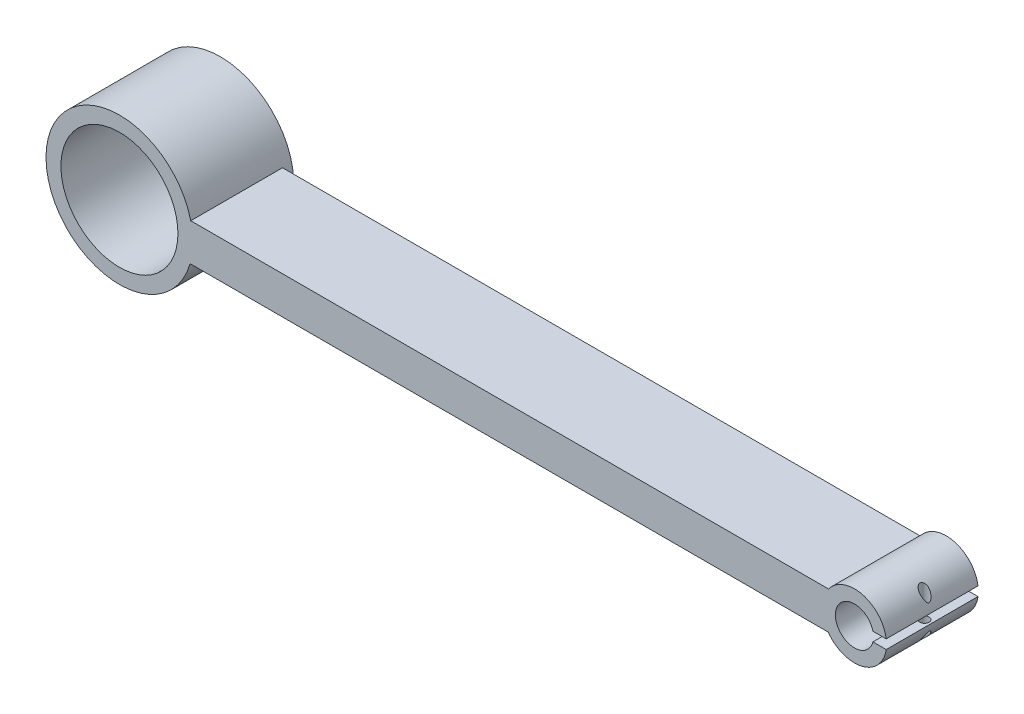
ISO-10303-21;
HEADER;
FILE_DESCRIPTION(('STEP AP214'),'2;1');
FILE_NAME('part.step','',(''),(''),'','','');
FILE_SCHEMA(('AUTOMOTIVE_DESIGN { 1 0 10303 214 1 1 1 1 }'));
ENDSEC;
DATA;
#1=APPLICATION_CONTEXT('core data for automotive mechanical design processes');
#2=APPLICATION_PROTOCOL_DEFINITION('international standard','automotive_design',2000,#1);
#3=PRODUCT_CONTEXT('',#1,'mechanical');
#4=PRODUCT('Part','Part','',(#3));
#5=PRODUCT_RELATED_PRODUCT_CATEGORY('part','',(#4));
#6=PRODUCT_DEFINITION_FORMATION('','',#4);
#7=PRODUCT_DEFINITION_CONTEXT('part definition',#1,'design');
#8=PRODUCT_DEFINITION('design','',#6,#7);
#9=PRODUCT_DEFINITION_SHAPE('','',#8);
#10=(LENGTH_UNIT() NAMED_UNIT(*) SI_UNIT(.MILLI.,.METRE.));
#11=(NAMED_UNIT(*) PLANE_ANGLE_UNIT() SI_UNIT($,.RADIAN.));
#12=(NAMED_UNIT(*) SI_UNIT($,.STERADIAN.) SOLID_ANGLE_UNIT());
#13=UNCERTAINTY_MEASURE_WITH_UNIT(LENGTH_MEASURE(1.E-05),#10,'distance_accuracy_value','');
#14=(GEOMETRIC_REPRESENTATION_CONTEXT(3) GLOBAL_UNCERTAINTY_ASSIGNED_CONTEXT((#13)) GLOBAL_UNIT_ASSIGNED_CONTEXT((#10,
#11,#12)) REPRESENTATION_CONTEXT('',''));
#15=CARTESIAN_POINT('',(0.,0.,0.));
#16=DIRECTION('',(0.,0.,1.));
#17=DIRECTION('',(1.,0.,0.));
#18=AXIS2_PLACEMENT_3D('',#15,#16,#17);
#19=CARTESIAN_POINT('',(-15.4173938584625,11.0586430197551,20.));
#20=DIRECTION('',(0.,0.,-1.));
#21=DIRECTION('',(-1.,0.,0.));
#22=AXIS2_PLACEMENT_3D('',#19,#20,#21);
#23=CYLINDRICAL_SURFACE('',#22,7.);
#24=CARTESIAN_POINT('',(-9.96233803526639,6.67203089126529,11.1863841904261));
#25=CARTESIAN_POINT('',(-9.91588741202312,6.72979347042278,11.1863811046901));
#26=CARTESIAN_POINT('',(-9.87037916629754,6.78826998566342,11.1831559129227));
#27=CARTESIAN_POINT('',(-9.78151831776924,6.90625130352395,11.170923105762));
#28=CARTESIAN_POINT('',(-9.73816586843728,6.96575617894743,11.1619150793229));
#29=CARTESIAN_POINT('',(-9.65377440995072,7.08547490682009,11.1385961733103));
#30=CARTESIAN_POINT('',(-9.61273868427565,7.14568962620999,11.1242779747952));
#31=CARTESIAN_POINT('',(-9.53319132843795,7.26636406297204,11.0906507079387));
#32=CARTESIAN_POINT('',(-9.49467892673768,7.32682369939732,11.07134317416));
#33=CARTESIAN_POINT('',(-9.4261509565225,7.43806591572613,11.0312631123589));
#34=CARTESIAN_POINT('',(-9.39575325346866,7.48887087637309,11.0112018613022));
#35=CARTESIAN_POINT('',(-9.33689950036506,7.59006810315898,10.9675180798771));
#36=CARTESIAN_POINT('',(-9.30844310934357,7.6404604403957,10.9438961772523));
#37=CARTESIAN_POINT('',(-9.25357927504564,7.74041475261705,10.8928308543546));
#38=CARTESIAN_POINT('',(-9.22717149102198,7.78997686461409,10.8653880717446));
#39=CARTESIAN_POINT('',(-9.17659986551855,7.88760170770046,10.806167762669));
#40=CARTESIAN_POINT('',(-9.15243389353116,7.93566583294171,10.7743944241696));
#41=CARTESIAN_POINT('',(-9.1066088765714,8.02933290355979,10.7054718572318));
#42=CARTESIAN_POINT('',(-9.08495707341985,8.07492854674381,10.6683077605688));
#43=CARTESIAN_POINT('',(-9.04504186190114,8.16117202380708,10.5871462611141));
#44=CARTESIAN_POINT('',(-9.02675941078193,8.20184718793249,10.5431900160503));
#45=CARTESIAN_POINT('',(-9.00419871681429,8.25307191976481,10.4735346315221));
#46=CARTESIAN_POINT('',(-8.99783872899904,8.2676712079012,10.4515257774922));
#47=CARTESIAN_POINT('',(-8.98637347059837,8.29419325661853,10.405597810867));
#48=CARTESIAN_POINT('',(-8.98126845420878,8.30611547491381,10.3816783125665));
#49=CARTESIAN_POINT('',(-8.97261897117924,8.32642738373215,10.331666313186));
#50=CARTESIAN_POINT('',(-8.96909713951293,8.33476576623937,10.3055482669681));
#51=CARTESIAN_POINT('',(-8.96413797995757,8.34653457055063,10.2520523726631));
#52=CARTESIAN_POINT('',(-8.96269541209194,8.3499773295762,10.2246778714605));
#53=CARTESIAN_POINT('',(-8.96213562094429,8.35131214929104,10.1732137827095));
#54=CARTESIAN_POINT('',(-8.96274966697562,8.34984569297573,10.1491424021101));
#55=CARTESIAN_POINT('',(-8.96564808881527,8.34294975254955,10.1016715045965));
#56=CARTESIAN_POINT('',(-8.96793444343041,8.33751557353106,10.0782728177859));
#57=CARTESIAN_POINT('',(-8.9746991732745,8.32153215476774,10.0270234257096));
#58=CARTESIAN_POINT('',(-8.97958321847112,8.31004250123957,9.9995260282032));
#59=CARTESIAN_POINT('',(-8.99107560018068,8.28327868553996,9.946842782539));
#60=CARTESIAN_POINT('',(-8.99768784983148,8.26799593875402,9.92166235788391));
#61=CARTESIAN_POINT('',(-9.01762889638335,8.22244962403955,9.85553353133482));
#62=CARTESIAN_POINT('',(-9.03228600294514,8.18952144635398,9.81685221380163));
#63=CARTESIAN_POINT('',(-9.06423999338413,8.11943536156481,9.74482597431077));
#64=CARTESIAN_POINT('',(-9.08154496412816,8.0822645886014,9.71149806408805));
#65=CARTESIAN_POINT('',(-9.11932048442707,8.00310508684312,9.64712950766517));
#66=CARTESIAN_POINT('',(-9.13992093147152,7.96096049888669,9.61635974385076));
#67=CARTESIAN_POINT('',(-9.1830597938885,7.87502903276202,9.55867243118016));
#68=CARTESIAN_POINT('',(-9.2056001718053,7.83124051735466,9.53175885856641));
#69=CARTESIAN_POINT('',(-9.25246277752653,7.7425996379366,9.48121323139619));
#70=CARTESIAN_POINT('',(-9.27678858273812,7.69774526693796,9.45758805589589));
#71=CARTESIAN_POINT('',(-9.32707350714224,7.60745898298816,9.41336461389276));
#72=CARTESIAN_POINT('',(-9.3530330169249,7.56202693401193,9.39276707520131));
#73=CARTESIAN_POINT('',(-9.4184561312045,7.45051555129258,9.34587238257925));
#74=CARTESIAN_POINT('',(-9.45877393139208,7.38427471517899,9.32113676974205));
#75=CARTESIAN_POINT('',(-9.54253095020002,7.25178923206281,9.27754433907535));
#76=CARTESIAN_POINT('',(-9.5859718126056,7.18554460166388,9.2586906454107));
#77=CARTESIAN_POINT('',(-9.67572471161684,7.05369851604295,9.22716010880352));
#78=CARTESIAN_POINT('',(-9.7220313783229,6.98809610960861,9.21447208549793));
#79=CARTESIAN_POINT('',(-9.81732959731699,6.85795454869612,9.19576418592637));
#80=CARTESIAN_POINT('',(-9.86631942635274,6.79341474562055,9.18974008128403));
#81=CARTESIAN_POINT('',(-9.98117269958018,6.64747367547732,9.18446491251165));
#82=CARTESIAN_POINT('',(-10.0478268888646,6.56657923834444,9.1876690537101));
#83=CARTESIAN_POINT('',(-10.1837181759982,6.40897581489033,9.20878167797851));
#84=CARTESIAN_POINT('',(-10.2529510041956,6.33226038619733,9.22666680295695));
#85=CARTESIAN_POINT('',(-10.3732807118647,6.20452111922398,9.27308230534975));
#86=CARTESIAN_POINT('',(-10.4243680074107,6.15203916744308,9.29758624167702));
#87=CARTESIAN_POINT('',(-10.5248479569149,6.05184830198296,9.35753315549568));
#88=CARTESIAN_POINT('',(-10.5742427922508,6.00413307985823,9.39296141449196));
#89=CARTESIAN_POINT('',(-10.6574449634015,5.92587168244149,9.46588958416142));
#90=CARTESIAN_POINT('',(-10.6921561374006,5.8939477106877,9.50087045501781));
#91=CARTESIAN_POINT('',(-10.7575428255412,5.83487794726763,9.57794846866202));
#92=CARTESIAN_POINT('',(-10.788223180695,5.80772641041211,9.6200369337194));
#93=CARTESIAN_POINT('',(-10.8390445651025,5.76339391408646,9.70332143248239));
#94=CARTESIAN_POINT('',(-10.8600902996544,5.74530414512313,9.74347827503092));
#95=CARTESIAN_POINT('',(-10.8969914959593,5.71387440729548,9.82786059444788));
#96=CARTESIAN_POINT('',(-10.9128489245131,5.70053263837449,9.87208452138854));
#97=CARTESIAN_POINT('',(-10.9384174616501,5.67913986011565,9.96379485104065));
#98=CARTESIAN_POINT('',(-10.9480944925707,5.6711181756544,10.0112977687226));
#99=CARTESIAN_POINT('',(-10.9604317841517,5.66090677761585,10.107820533926));
#100=CARTESIAN_POINT('',(-10.9630949503616,5.65871464909484,10.1568397447938));
#101=CARTESIAN_POINT('',(-10.9612979165195,5.66019816392576,10.2499028859236));
#102=CARTESIAN_POINT('',(-10.9574999142215,5.66332831623747,10.2939707276479));
#103=CARTESIAN_POINT('',(-10.9442681042822,5.67429357843327,10.3806377257048));
#104=CARTESIAN_POINT('',(-10.9348348107874,5.68212825909106,10.4232370156485));
#105=CARTESIAN_POINT('',(-10.9108970032726,5.70217711459237,10.5058988981271));
#106=CARTESIAN_POINT('',(-10.896390598355,5.714392922454,10.5459605382199));
#107=CARTESIAN_POINT('',(-10.8630810740007,5.7427505901652,10.6227507430592));
#108=CARTESIAN_POINT('',(-10.8442768243645,5.75889348278789,10.6594784275232));
#109=CARTESIAN_POINT('',(-10.8009690641317,5.79655896001986,10.7329266519277));
#110=CARTESIAN_POINT('',(-10.7760673160593,5.8184766393442,10.7692078815129));
#111=CARTESIAN_POINT('',(-10.7231250991604,5.86584911220184,10.8368075489005));
#112=CARTESIAN_POINT('',(-10.6950825865522,5.8913062115639,10.868122722762));
#113=CARTESIAN_POINT('',(-10.6213304860195,5.95948246055981,10.9411489895456));
#114=CARTESIAN_POINT('',(-10.5741528337019,6.00418480035295,10.9795388544235));
#115=CARTESIAN_POINT('',(-10.4774137216048,6.09868244099228,11.0455363681903));
#116=CARTESIAN_POINT('',(-10.4278470658127,6.14848913534172,11.0731192028344));
#117=CARTESIAN_POINT('',(-10.3077498616343,6.27306666349478,11.1280133967847));
#118=CARTESIAN_POINT('',(-10.2369729716284,6.34968680987996,11.1505573761596));
#119=CARTESIAN_POINT('',(-10.0975940687213,6.50771985972021,11.1797577947258));
#120=CARTESIAN_POINT('',(-10.0289957375231,6.58914027464443,11.1863886185274));
#121=CARTESIAN_POINT('',(-9.96233803526639,6.67203089126529,11.1863841904261));
#122=B_SPLINE_CURVE_WITH_KNOTS('',3,(#24,#25,#26,#27,#28,#29,#30,#31,#32,#33,#34,#35,#36,#37,
#38,#39,#40,#41,#42,#43,#44,#45,#46,#47,#48,#49,#50,#51,#52,#53,#54,#55,#56,#57,#58,#59,#60,#61,
#62,#63,#64,#65,#66,#67,#68,#69,#70,#71,#72,#73,#74,#75,#76,#77,#78,#79,#80,#81,#82,#83,#84,#85,
#86,#87,#88,#89,#90,#91,#92,#93,#94,#95,#96,#97,#98,#99,#100,#101,#102,#103,#104,#105,#106,#107,
#108,#109,#110,#111,#112,#113,#114,#115,#116,#117,#118,#119,#120,#121),.UNSPECIFIED.,.T.,.F.,(4,
2,2,2,2,2,2,2,2,2,2,2,2,2,2,2,2,2,2,2,2,2,2,2,2,2,2,2,2,2,2,2,2,2,2,2,2,2,2,2,2,2,2,2,2,2,2,2,
4),(0.,0.22224684293457,0.444509484998074,0.667079614213007,0.889581369163125,1.07699216120469,
1.26436995124261,1.45171650738702,1.63888315444327,1.82657620287766,2.01317354446964,
2.09450028432988,2.17584348346175,2.25831529799915,2.34057890877833,2.41253432547743,
2.48457502350026,2.57466454113514,2.66495984095441,2.822684483498,2.98090082089381,
3.14895020008696,3.31717163222342,3.48573984440662,3.65434851254024,3.89824158376912,
4.14226397843178,4.38584221455391,4.62926580708913,4.94291196050339,5.25606005413005,
5.48701200262517,5.7176541359319,5.89317016026804,6.0684734244772,6.2143096719676,
6.36009057112802,6.50666849559699,6.65318568943349,6.7855729967092,6.91794822722015,
7.05037285054465,7.18283233757307,7.3297657318626,7.47679530144646,7.70197343215789,
7.92766561072251,8.24608267911881,8.56501196035221),.UNSPECIFIED.);
#123=CARTESIAN_POINT('',(-9.96233803526639,6.67203089126529,11.1863841904261));
#124=VERTEX_POINT('',#123);
#125=EDGE_CURVE('E116',#124,#124,#122,.T.);
#126=ORIENTED_EDGE('',*,*,#125,.T.);
#127=EDGE_LOOP('',(#126));
#128=FACE_BOUND('',#127,.T.);
#129=CARTESIAN_POINT('',(-15.4173938584625,11.0586430197551,0.));
#130=DIRECTION('',(0.,0.,1.));
#131=DIRECTION('',(-1.,0.,0.));
#132=AXIS2_PLACEMENT_3D('',#129,#130,#131);
#133=CIRCLE('',#132,7.);
#134=CARTESIAN_POINT('',(-21.1386912284876,7.02543630502509,0.));
#135=VERTEX_POINT('',#134);
#136=CARTESIAN_POINT('',(-8.48961903220039,10.0556794328742,0.));
#137=VERTEX_POINT('',#136);
#138=EDGE_CURVE('E136',#135,#137,#133,.T.);
#139=ORIENTED_EDGE('',*,*,#138,.T.);
#140=DIRECTION('',(0.,0.,-1.));
#141=VECTOR('',#140,1.);
#142=CARTESIAN_POINT('',(-8.48961903220039,10.0556794328742,20.));
#143=LINE('',#142,#141);
#144=CARTESIAN_POINT('',(-8.48961903220039,10.0556794328742,20.));
#145=VERTEX_POINT('',#144);
#146=EDGE_CURVE('E182',#137,#145,#143,.F.);
#147=ORIENTED_EDGE('',*,*,#146,.T.);
#148=CARTESIAN_POINT('',(-15.4173938584625,11.0586430197551,20.));
#149=DIRECTION('',(0.,0.,1.));
#150=DIRECTION('',(-1.,0.,0.));
#151=AXIS2_PLACEMENT_3D('',#148,#149,#150);
#152=CIRCLE('',#151,7.);
#153=CARTESIAN_POINT('',(-21.1386912284876,7.02543630502509,20.));
#154=VERTEX_POINT('',#153);
#155=EDGE_CURVE('E122',#154,#145,#152,.T.);
#156=ORIENTED_EDGE('',*,*,#155,.F.);
#157=DIRECTION('',(0.,0.,-1.));
#158=VECTOR('',#157,1.);
#159=CARTESIAN_POINT('',(-21.1386912284876,7.02543630502509,20.));
#160=LINE('',#159,#158);
#161=EDGE_CURVE('E145',#154,#135,#160,.T.);
#162=ORIENTED_EDGE('',*,*,#161,.T.);
#163=EDGE_LOOP('',(#139,#147,#156,#162));
#164=FACE_BOUND('',#163,.T.);
#165=ADVANCED_FACE('F35',(#128,#164),#23,.T.);
#166=CARTESIAN_POINT('',(-175.583907282956,11.3902747403108,0.));
#167=DIRECTION('',(0.,0.,1.));
#168=DIRECTION('',(1.,0.,0.));
#169=AXIS2_PLACEMENT_3D('',#166,#167,#168);
#170=PLANE('',#169);
#171=CARTESIAN_POINT('',(-15.4173938584625,11.0586430197551,0.));
#172=DIRECTION('',(0.,0.,1.));
#173=DIRECTION('',(1.,0.,0.));
#174=AXIS2_PLACEMENT_3D('',#171,#172,#173);
#175=CIRCLE('',#174,4.15);
#176=CARTESIAN_POINT('',(-11.3904143398417,12.061606606636,0.));
#177=VERTEX_POINT('',#176);
#178=CARTESIAN_POINT('',(-11.3904143398417,10.0556794328742,0.));
#179=VERTEX_POINT('',#178);
#180=EDGE_CURVE('E156',#177,#179,#175,.T.);
#181=ORIENTED_EDGE('',*,*,#180,.T.);
#182=DIRECTION('',(1.,0.,0.));
#183=VECTOR('',#182,1.);
#184=CARTESIAN_POINT('',(-175.583907282956,10.0556794328742,0.));
#185=LINE('',#184,#183);
#186=EDGE_CURVE('E50',#179,#137,#185,.T.);
#187=ORIENTED_EDGE('',*,*,#186,.T.);
#188=ORIENTED_EDGE('',*,*,#138,.F.);
#189=DIRECTION('',(1.,0.,0.));
#190=VECTOR('',#189,1.);
#191=CARTESIAN_POINT('',(-160.19078591548,7.02543630502509,0.));
#192=LINE('',#191,#190);
#193=CARTESIAN_POINT('',(-160.19078591548,7.02543630502509,0.));
#194=VERTEX_POINT('',#193);
#195=EDGE_CURVE('E133',#194,#135,#192,.T.);
#196=ORIENTED_EDGE('',*,*,#195,.F.);
#197=CARTESIAN_POINT('',(-175.583907282956,11.3902747403108,0.));
#198=DIRECTION('',(0.,0.,-1.));
#199=DIRECTION('',(-1.,0.,0.));
#200=AXIS2_PLACEMENT_3D('',#197,#198,#199);
#201=CIRCLE('',#200,16.);
#202=CARTESIAN_POINT('',(-160.043113059127,15.196022353146,0.));
#203=VERTEX_POINT('',#202);
#204=EDGE_CURVE('E174',#203,#194,#201,.T.);
#205=ORIENTED_EDGE('',*,*,#204,.F.);
#206=DIRECTION('',(-1.,0.,0.));
#207=VECTOR('',#206,1.);
#208=CARTESIAN_POINT('',(-160.043113059127,15.196022353146,0.));
#209=LINE('',#208,#207);
#210=CARTESIAN_POINT('',(-21.0638168192077,15.196022353146,0.));
#211=VERTEX_POINT('',#210);
#212=EDGE_CURVE('E139',#211,#203,#209,.T.);
#213=ORIENTED_EDGE('',*,*,#212,.F.);
#214=CARTESIAN_POINT('',(-8.48961903220039,12.061606606636,0.));
#215=VERTEX_POINT('',#214);
#216=EDGE_CURVE('E135',#215,#211,#133,.T.);
#217=ORIENTED_EDGE('',*,*,#216,.F.);
#218=DIRECTION('',(-1.,0.,0.));
#219=VECTOR('',#218,1.);
#220=CARTESIAN_POINT('',(-175.583907282956,12.061606606636,0.));
#221=LINE('',#220,#219);
#222=EDGE_CURVE('E101',#215,#177,#221,.T.);
#223=ORIENTED_EDGE('',*,*,#222,.T.);
#224=EDGE_LOOP('',(#181,#187,#188,#196,#205,#213,#217,#223));
#225=FACE_BOUND('',#224,.T.);
#226=ADVANCED_FACE('F155',(#225),#170,.F.);
#227=CARTESIAN_POINT('',(-175.583907282956,11.3902747403108,20.));
#228=DIRECTION('',(0.,0.,1.));
#229=DIRECTION('',(1.,0.,0.));
#230=AXIS2_PLACEMENT_3D('',#227,#228,#229);
#231=PLANE('',#230);
#232=DIRECTION('',(1.,0.,0.));
#233=VECTOR('',#232,1.);
#234=CARTESIAN_POINT('',(-12.5236236468098,10.0556794328742,20.));
#235=LINE('',#234,#233);
#236=CARTESIAN_POINT('',(-11.3904143398417,10.0556794328742,20.));
#237=VERTEX_POINT('',#236);
#238=EDGE_CURVE('E115',#237,#145,#235,.T.);
#239=ORIENTED_EDGE('',*,*,#238,.F.);
#240=CARTESIAN_POINT('',(-15.4173938584625,11.0586430197551,20.));
#241=DIRECTION('',(0.,0.,1.));
#242=DIRECTION('',(1.,0.,0.));
#243=AXIS2_PLACEMENT_3D('',#240,#241,#242);
#244=CIRCLE('',#243,4.15);
#245=CARTESIAN_POINT('',(-11.3904143398417,12.061606606636,20.));
#246=VERTEX_POINT('',#245);
#247=EDGE_CURVE('E114',#246,#237,#244,.T.);
#248=ORIENTED_EDGE('',*,*,#247,.F.);
#249=DIRECTION('',(-1.,0.,0.));
#250=VECTOR('',#249,1.);
#251=CARTESIAN_POINT('',(-12.5236236468098,12.061606606636,20.));
#252=LINE('',#251,#250);
#253=CARTESIAN_POINT('',(-8.48961903220039,12.061606606636,20.));
#254=VERTEX_POINT('',#253);
#255=EDGE_CURVE('E58',#254,#246,#252,.T.);
#256=ORIENTED_EDGE('',*,*,#255,.F.);
#257=CARTESIAN_POINT('',(-21.0638168192077,15.196022353146,20.));
#258=VERTEX_POINT('',#257);
#259=EDGE_CURVE('E111',#254,#258,#152,.T.);
#260=ORIENTED_EDGE('',*,*,#259,.T.);
#261=DIRECTION('',(-1.,0.,0.));
#262=VECTOR('',#261,1.);
#263=CARTESIAN_POINT('',(-160.043113059127,15.196022353146,20.));
#264=LINE('',#263,#262);
#265=CARTESIAN_POINT('',(-160.043113059127,15.196022353146,20.));
#266=VERTEX_POINT('',#265);
#267=EDGE_CURVE('E126',#258,#266,#264,.T.);
#268=ORIENTED_EDGE('',*,*,#267,.T.);
#269=CARTESIAN_POINT('',(-175.583907282956,11.3902747403108,20.));
#270=DIRECTION('',(0.,0.,1.));
#271=DIRECTION('',(1.,0.,0.));
#272=AXIS2_PLACEMENT_3D('',#269,#270,#271);
#273=CIRCLE('',#272,16.);
#274=CARTESIAN_POINT('',(-160.19078591548,7.02543630502509,20.));
#275=VERTEX_POINT('',#274);
#276=EDGE_CURVE('E127',#266,#275,#273,.T.);
#277=ORIENTED_EDGE('',*,*,#276,.T.);
#278=DIRECTION('',(1.,0.,0.));
#279=VECTOR('',#278,1.);
#280=CARTESIAN_POINT('',(-160.19078591548,7.02543630502509,20.));
#281=LINE('',#280,#279);
#282=EDGE_CURVE('E123',#275,#154,#281,.T.);
#283=ORIENTED_EDGE('',*,*,#282,.T.);
#284=ORIENTED_EDGE('',*,*,#155,.T.);
#285=EDGE_LOOP('',(#239,#248,#256,#260,#268,#277,#283,#284));
#286=FACE_BOUND('',#285,.T.);
#287=CARTESIAN_POINT('',(-175.583907282956,11.3902747403108,20.));
#288=DIRECTION('',(0.,0.,1.));
#289=DIRECTION('',(1.,0.,0.));
#290=AXIS2_PLACEMENT_3D('',#287,#288,#289);
#291=CIRCLE('',#290,12.75);
#292=CARTESIAN_POINT('',(-162.833907282956,11.3902747403108,20.));
#293=VERTEX_POINT('',#292);
#294=EDGE_CURVE('E160',#293,#293,#291,.T.);
#295=ORIENTED_EDGE('',*,*,#294,.F.);
#296=EDGE_LOOP('',(#295));
#297=FACE_BOUND('',#296,.T.);
#298=ADVANCED_FACE('F109',(#286,#297),#231,.T.);
#299=CARTESIAN_POINT('',(-175.583907282956,11.3902747403108,20.));
#300=DIRECTION('',(0.,0.,-1.));
#301=DIRECTION('',(-1.,0.,0.));
#302=AXIS2_PLACEMENT_3D('',#299,#300,#301);
#303=CYLINDRICAL_SURFACE('',#302,16.);
#304=DIRECTION('',(0.,0.,-1.));
#305=VECTOR('',#304,1.);
#306=CARTESIAN_POINT('',(-160.043113059127,15.196022353146,20.));
#307=LINE('',#306,#305);
#308=EDGE_CURVE('E132',#266,#203,#307,.T.);
#309=ORIENTED_EDGE('',*,*,#308,.T.);
#310=ORIENTED_EDGE('',*,*,#204,.T.);
#311=DIRECTION('',(0.,0.,-1.));
#312=VECTOR('',#311,1.);
#313=CARTESIAN_POINT('',(-160.19078591548,7.02543630502509,20.));
#314=LINE('',#313,#312);
#315=EDGE_CURVE('E148',#275,#194,#314,.T.);
#316=ORIENTED_EDGE('',*,*,#315,.F.);
#317=ORIENTED_EDGE('',*,*,#276,.F.);
#318=EDGE_LOOP('',(#309,#310,#316,#317));
#319=FACE_BOUND('',#318,.T.);
#320=CARTESIAN_POINT('',(-175.583907282956,11.3902747403108,-2.));
#321=DIRECTION('',(0.,0.,-1.));
#322=DIRECTION('',(-1.,0.,0.));
#323=AXIS2_PLACEMENT_3D('',#320,#321,#322);
#324=CIRCLE('',#323,16.);
#325=CARTESIAN_POINT('',(-191.583907282956,11.3902747403108,-2.));
#326=VERTEX_POINT('',#325);
#327=EDGE_CURVE('E206',#326,#326,#324,.T.);
#328=ORIENTED_EDGE('',*,*,#327,.F.);
#329=EDGE_LOOP('',(#328));
#330=FACE_BOUND('',#329,.T.);
#331=ADVANCED_FACE('F37',(#319,#330),#303,.T.);
#332=CARTESIAN_POINT('',(-160.19078591548,7.02543630502509,20.));
#333=DIRECTION('',(0.,1.,0.));
#334=DIRECTION('',(0.,0.,1.));
#335=AXIS2_PLACEMENT_3D('',#332,#333,#334);
#336=PLANE('',#335);
#337=ORIENTED_EDGE('',*,*,#195,.T.);
#338=ORIENTED_EDGE('',*,*,#161,.F.);
#339=ORIENTED_EDGE('',*,*,#282,.F.);
#340=ORIENTED_EDGE('',*,*,#315,.T.);
#341=EDGE_LOOP('',(#337,#338,#339,#340));
#342=FACE_BOUND('',#341,.T.);
#343=ADVANCED_FACE('F177',(#342),#336,.F.);
#344=CARTESIAN_POINT('',(-9.96233803526639,15.445255148245,11.1863841904261));
#345=CARTESIAN_POINT('',(-10.0357905383143,15.5365934161329,11.1863915639464));
#346=CARTESIAN_POINT('',(-10.1116458314947,15.6262013122609,11.178347762579));
#347=CARTESIAN_POINT('',(-10.265862463815,15.7994308341134,11.142481961906));
#348=CARTESIAN_POINT('',(-10.3442218826324,15.8830568949356,11.1146747865676));
#349=CARTESIAN_POINT('',(-10.4661905235235,16.0073532411868,11.0516402955723));
#350=CARTESIAN_POINT('',(-10.5105826609381,16.0513224777693,11.0244242833403));
#351=CARTESIAN_POINT('',(-10.5970408538258,16.1348401960949,10.9609926534273));
#352=CARTESIAN_POINT('',(-10.6391105604136,16.1743957228222,10.9247916838863));
#353=CARTESIAN_POINT('',(-10.7117818623073,16.2412307752364,10.8501211989507));
#354=CARTESIAN_POINT('',(-10.7430952103097,16.2694438669888,10.8131878017936));
#355=CARTESIAN_POINT('',(-10.8012362267322,16.3210184873755,10.7329162127596));
#356=CARTESIAN_POINT('',(-10.8280681730466,16.3443846480516,10.6895842042555));
#357=CARTESIAN_POINT('',(-10.8718106217387,16.3820230037404,10.6044454121458));
#358=CARTESIAN_POINT('',(-10.8896188870353,16.3971487413669,10.5634794464069));
#359=CARTESIAN_POINT('',(-10.9198765875072,16.4226650341952,10.4782103180168));
#360=CARTESIAN_POINT('',(-10.9323283056157,16.4330576067592,10.4339085865305));
#361=CARTESIAN_POINT('',(-10.9511047028344,16.4486721672553,10.3429282140039));
#362=CARTESIAN_POINT('',(-10.9574035318378,16.4538723424011,10.2962404046092));
#363=CARTESIAN_POINT('',(-10.9633229954684,16.4587605260228,10.2021566943751));
#364=CARTESIAN_POINT('',(-10.96294505837,16.4584497133932,10.1547609471431));
#365=CARTESIAN_POINT('',(-10.9558211524578,16.4525641869127,10.0643320794231));
#366=CARTESIAN_POINT('',(-10.9495462277585,16.4473788358504,10.021234736616));
#367=CARTESIAN_POINT('',(-10.931692381562,16.432525769046,9.93696997983175));
#368=CARTESIAN_POINT('',(-10.9201135771371,16.4228581522406,9.89580252327847));
#369=CARTESIAN_POINT('',(-10.8919353896801,16.3991084294421,9.81528253753801));
#370=CARTESIAN_POINT('',(-10.8752119545693,16.3849168918425,9.77600623392825));
#371=CARTESIAN_POINT('',(-10.8377205100258,16.3527155053568,9.70113997636221));
#372=CARTESIAN_POINT('',(-10.816950546959,16.3347038117539,9.665551815779));
#373=CARTESIAN_POINT('',(-10.76370962717,16.2878782730989,9.5856323956062));
#374=CARTESIAN_POINT('',(-10.7297957896533,16.2575635519965,9.54313695977031));
#375=CARTESIAN_POINT('',(-10.6580138242017,16.1919344854634,9.46609180747771));
#376=CARTESIAN_POINT('',(-10.6201384514929,16.1566109365168,9.43155703215295));
#377=CARTESIAN_POINT('',(-10.5283476519379,16.0688849613198,9.35925156816364));
#378=CARTESIAN_POINT('',(-10.4734945501217,16.0148588888878,9.32465152598965));
#379=CARTESIAN_POINT('',(-10.3626622312641,15.9017832284008,9.26789132350992));
#380=CARTESIAN_POINT('',(-10.3066816433014,15.8427272027025,9.24574738936018));
#381=CARTESIAN_POINT('',(-10.1709014839322,15.6941976765137,9.20479438966702));
#382=CARTESIAN_POINT('',(-10.0914856968618,15.6027960189601,9.19176328720071));
#383=CARTESIAN_POINT('',(-9.93710100858052,15.4153899896625,9.1837062481763));
#384=CARTESIAN_POINT('',(-9.8621463377006,15.3193724885361,9.18873508655903));
#385=CARTESIAN_POINT('',(-9.74210711449785,15.1571408932408,9.20971802280868));
#386=CARTESIAN_POINT('',(-9.69534380544865,15.0915750518792,9.22150768027225));
#387=CARTESIAN_POINT('',(-9.60473269934234,14.9598421469862,9.25129349452082));
#388=CARTESIAN_POINT('',(-9.56088469406725,14.8936751267769,9.26928920748527));
#389=CARTESIAN_POINT('',(-9.47637616401627,14.7614063487664,9.31113594427877));
#390=CARTESIAN_POINT('',(-9.43570826561057,14.6953048134482,9.3349728591191));
#391=CARTESIAN_POINT('',(-9.3576153196355,14.5636296058856,9.38854067488421));
#392=CARTESIAN_POINT('',(-9.32018778813234,14.4980555648984,9.41826700269761));
#393=CARTESIAN_POINT('',(-9.25725560219658,14.3836829228623,9.47629362596718));
#394=CARTESIAN_POINT('',(-9.23103088134447,14.3346000945307,9.50325483440632));
#395=CARTESIAN_POINT('',(-9.18070342507256,14.2377416336464,9.56145879686929));
#396=CARTESIAN_POINT('',(-9.15660394186951,14.1899680790875,9.59270793207999));
#397=CARTESIAN_POINT('',(-9.1107005589192,14.0964642427433,9.66063214501376));
#398=CARTESIAN_POINT('',(-9.08891926566048,14.0507562138796,9.69735351466726));
#399=CARTESIAN_POINT('',(-9.04864077612007,13.9640216423718,9.7775194092426));
#400=CARTESIAN_POINT('',(-9.03012933673487,13.922975088985,9.82093315158662));
#401=CARTESIAN_POINT('',(-9.00710504481836,13.8708501701671,9.8897224786929));
#402=CARTESIAN_POINT('',(-9.0005828523055,13.855920435095,9.91147332116529));
#403=CARTESIAN_POINT('',(-8.98874865304662,13.8286140017512,9.95687319765718));
#404=CARTESIAN_POINT('',(-8.98343681318765,13.8162376555708,9.98052249283384));
#405=CARTESIAN_POINT('',(-8.97431535098991,13.7948590329144,10.0300161140724));
#406=CARTESIAN_POINT('',(-8.97052700676951,13.785904629793,10.0558857914263));
#407=CARTESIAN_POINT('',(-8.96498164153876,13.7727598694753,10.1090052367119));
#408=CARTESIAN_POINT('',(-8.96321951400713,13.76855753644,10.1362513537908));
#409=CARTESIAN_POINT('',(-8.96203952598169,13.7657451625895,10.1881435809362));
#410=CARTESIAN_POINT('',(-8.96239019477482,13.7665829296471,10.2127546176799));
#411=CARTESIAN_POINT('',(-8.9648566175673,13.772454468505,10.2613861535761));
#412=CARTESIAN_POINT('',(-8.96697431425496,13.7774928585074,10.2854059728028));
#413=CARTESIAN_POINT('',(-8.97330791938743,13.7924741465422,10.3367674270233));
#414=CARTESIAN_POINT('',(-8.9778533966155,13.8031840172663,10.3638389630819));
#415=CARTESIAN_POINT('',(-8.98864445559009,13.8283667929416,10.4157931273707));
#416=CARTESIAN_POINT('',(-8.99489371312825,13.8428478308708,10.4406708672552));
#417=CARTESIAN_POINT('',(-9.01362540399454,13.8857638717668,10.5053910127546));
#418=CARTESIAN_POINT('',(-9.02736110783056,13.9167512324593,10.5431491333732));
#419=CARTESIAN_POINT('',(-9.05737044763325,13.9829277357182,10.6135862000049));
#420=CARTESIAN_POINT('',(-9.07365162321773,14.0181292856014,10.646249461811));
#421=CARTESIAN_POINT('',(-9.1091600884256,14.0931127690592,10.7093273569079));
#422=CARTESIAN_POINT('',(-9.12850411165103,14.1330422325024,10.7394980549156));
#423=CARTESIAN_POINT('',(-9.16901587099781,14.2145662522339,10.796181785828));
#424=CARTESIAN_POINT('',(-9.19018547064886,14.2561624861996,10.8226910075941));
#425=CARTESIAN_POINT('',(-9.23420220944397,14.3404731305305,10.872625953573));
#426=CARTESIAN_POINT('',(-9.25705361731927,14.3831901958375,10.8960433781777));
#427=CARTESIAN_POINT('',(-9.3042769901692,14.4692462195124,10.9400394424712));
#428=CARTESIAN_POINT('',(-9.3286493472493,14.5125853360112,10.960617345695));
#429=CARTESIAN_POINT('',(-9.39196424483385,14.6223549064915,11.0091824049524));
#430=CARTESIAN_POINT('',(-9.43186369058409,14.6890142341889,11.0354201421119));
#431=CARTESIAN_POINT('',(-9.51486910993076,14.8224688756529,11.081947608793));
#432=CARTESIAN_POINT('',(-9.55797724552295,14.8892642510667,11.1022332815251));
#433=CARTESIAN_POINT('',(-9.64703272430491,15.0221394199122,11.1365685248648));
#434=CARTESIAN_POINT('',(-9.69296724118506,15.088221047199,11.1506441966224));
#435=CARTESIAN_POINT('',(-9.7876050839021,15.2194125346862,11.1721938925714));
#436=CARTESIAN_POINT('',(-9.83630545268254,15.2845233421442,11.1796748310573));
#437=CARTESIAN_POINT('',(-9.91128895119836,15.381199237909,11.1853956110569));
#438=CARTESIAN_POINT('',(-9.93666674665425,15.4133328727746,11.186381613417));
#439=CARTESIAN_POINT('',(-9.96233803526639,15.445255148245,11.1863841904261));
#440=B_SPLINE_CURVE_WITH_KNOTS('',3,(#344,#345,#346,#347,#348,#349,#350,#351,#352,#353,#354,
#355,#356,#357,#358,#359,#360,#361,#362,#363,#364,#365,#366,#367,#368,#369,#370,#371,#372,#373,
#374,#375,#376,#377,#378,#379,#380,#381,#382,#383,#384,#385,#386,#387,#388,#389,#390,#391,#392,
#393,#394,#395,#396,#397,#398,#399,#400,#401,#402,#403,#404,#405,#406,#407,#408,#409,#410,#411,
#412,#413,#414,#415,#416,#417,#418,#419,#420,#421,#422,#423,#424,#425,#426,#427,#428,#429,#430,
#431,#432,#433,#434,#435,#436,#437,#438,#439),.UNSPECIFIED.,.T.,.F.,(4,2,2,2,2,2,2,2,2,2,2,2,2,
2,2,2,2,2,2,2,2,2,2,2,2,2,2,2,2,2,2,2,2,2,2,2,2,2,2,2,2,2,2,2,2,2,2,4),(0.,0.351508632513864,
0.70275388587599,0.906594184500155,1.1101043211995,1.27758715413207,1.44490918461126,
1.58579346602714,1.72661764364458,1.86803095273014,2.00941401145925,2.14038446045239,
2.27135201868015,2.40576461163905,2.54024225953971,2.7259627077614,2.91202894153645,
3.16386079129773,3.41601993876322,3.77938911699728,4.1438613061441,4.38776441701156,
4.63165008897976,4.8749523815062,5.11806648580225,5.30342147772448,5.48905536397845,
5.67635955931522,5.86282660191189,5.94419543963873,6.02557548996447,6.10805565933829,
6.19032750138639,6.26376242050134,6.33727818124737,6.42518406513546,6.51328112168222,
6.66464816959635,6.81647236682856,6.97719349493879,7.13808067284991,7.29939131589052,
7.46074371851016,7.70643545125372,7.95229425486766,8.1971096130964,8.4416679866082,
8.56451852512601),.UNSPECIFIED.);
#441=CARTESIAN_POINT('',(-9.96233803526639,15.445255148245,11.1863841904261));
#442=VERTEX_POINT('',#441);
#443=EDGE_CURVE('E246',#442,#442,#440,.T.);
#444=ORIENTED_EDGE('',*,*,#443,.T.);
#445=EDGE_LOOP('',(#444));
#446=FACE_BOUND('',#445,.T.);
#447=ORIENTED_EDGE('',*,*,#259,.F.);
#448=DIRECTION('',(0.,0.,-1.));
#449=VECTOR('',#448,1.);
#450=CARTESIAN_POINT('',(-8.48961903220039,12.061606606636,20.));
#451=LINE('',#450,#449);
#452=EDGE_CURVE('E98',#254,#215,#451,.T.);
#453=ORIENTED_EDGE('',*,*,#452,.T.);
#454=ORIENTED_EDGE('',*,*,#216,.T.);
#455=DIRECTION('',(0.,0.,-1.));
#456=VECTOR('',#455,1.);
#457=CARTESIAN_POINT('',(-21.0638168192077,15.196022353146,20.));
#458=LINE('',#457,#456);
#459=EDGE_CURVE('E120',#258,#211,#458,.T.);
#460=ORIENTED_EDGE('',*,*,#459,.F.);
#461=EDGE_LOOP('',(#447,#453,#454,#460));
#462=FACE_BOUND('',#461,.T.);
#463=ADVANCED_FACE('F118',(#446,#462),#23,.T.);
#464=CARTESIAN_POINT('',(-160.043113059127,15.196022353146,20.));
#465=DIRECTION('',(0.,-1.,0.));
#466=DIRECTION('',(0.,0.,-1.));
#467=AXIS2_PLACEMENT_3D('',#464,#465,#466);
#468=PLANE('',#467);
#469=ORIENTED_EDGE('',*,*,#212,.T.);
#470=ORIENTED_EDGE('',*,*,#308,.F.);
#471=ORIENTED_EDGE('',*,*,#267,.F.);
#472=ORIENTED_EDGE('',*,*,#459,.T.);
#473=EDGE_LOOP('',(#469,#470,#471,#472));
#474=FACE_BOUND('',#473,.T.);
#475=ADVANCED_FACE('F225',(#474),#468,.F.);
#476=CARTESIAN_POINT('',(-15.4173938584625,11.0586430197551,20.));
#477=DIRECTION('',(0.,0.,-1.));
#478=DIRECTION('',(-1.,0.,0.));
#479=AXIS2_PLACEMENT_3D('',#476,#477,#478);
#480=CYLINDRICAL_SURFACE('',#479,4.15);
#481=DIRECTION('',(0.,0.,-1.));
#482=VECTOR('',#481,1.);
#483=CARTESIAN_POINT('',(-11.3904143398417,10.0556794328742,20.));
#484=LINE('',#483,#482);
#485=EDGE_CURVE('E11',#179,#237,#484,.F.);
#486=ORIENTED_EDGE('',*,*,#485,.F.);
#487=ORIENTED_EDGE('',*,*,#180,.F.);
#488=DIRECTION('',(0.,0.,-1.));
#489=VECTOR('',#488,1.);
#490=CARTESIAN_POINT('',(-11.3904143398417,12.061606606636,20.));
#491=LINE('',#490,#489);
#492=EDGE_CURVE('E44',#246,#177,#491,.T.);
#493=ORIENTED_EDGE('',*,*,#492,.F.);
#494=ORIENTED_EDGE('',*,*,#247,.T.);
#495=EDGE_LOOP('',(#486,#487,#493,#494));
#496=FACE_BOUND('',#495,.T.);
#497=ADVANCED_FACE('F159',(#496),#480,.F.);
#498=CARTESIAN_POINT('',(-175.583907282956,11.3902747403108,20.));
#499=DIRECTION('',(0.,0.,-1.));
#500=DIRECTION('',(-1.,0.,0.));
#501=AXIS2_PLACEMENT_3D('',#498,#499,#500);
#502=CYLINDRICAL_SURFACE('',#501,12.75);
#503=ORIENTED_EDGE('',*,*,#294,.T.);
#504=EDGE_LOOP('',(#503));
#505=FACE_BOUND('',#504,.T.);
#506=CARTESIAN_POINT('',(-175.583907282956,11.3902747403108,0.));
#507=DIRECTION('',(0.,0.,1.));
#508=DIRECTION('',(1.,0.,0.));
#509=AXIS2_PLACEMENT_3D('',#506,#507,#508);
#510=CIRCLE('',#509,12.75);
#511=CARTESIAN_POINT('',(-162.833907282956,11.3902747403108,0.));
#512=VERTEX_POINT('',#511);
#513=EDGE_CURVE('E164',#512,#512,#510,.T.);
#514=ORIENTED_EDGE('',*,*,#513,.F.);
#515=EDGE_LOOP('',(#514));
#516=FACE_BOUND('',#515,.T.);
#517=ADVANCED_FACE('F214',(#505,#516),#502,.F.);
#518=CARTESIAN_POINT('',(-175.583907282956,11.3902747403108,0.));
#519=DIRECTION('',(0.,0.,-1.));
#520=DIRECTION('',(-1.,0.,0.));
#521=AXIS2_PLACEMENT_3D('',#518,#519,#520);
#522=PLANE('',#521);
#523=CARTESIAN_POINT('',(-175.583907282956,11.3902747403108,0.));
#524=DIRECTION('',(0.,0.,-1.));
#525=DIRECTION('',(-1.,0.,0.));
#526=AXIS2_PLACEMENT_3D('',#523,#524,#525);
#527=CIRCLE('',#526,3.75000000000001);
#528=CARTESIAN_POINT('',(-179.333907282956,11.3902747403108,0.));
#529=VERTEX_POINT('',#528);
#530=EDGE_CURVE('E188',#529,#529,#527,.T.);
#531=ORIENTED_EDGE('',*,*,#530,.T.);
#532=EDGE_LOOP('',(#531));
#533=FACE_BOUND('',#532,.T.);
#534=CARTESIAN_POINT('',(-167.083907282956,11.3902747403108,0.));
#535=DIRECTION('',(0.,0.,-1.));
#536=DIRECTION('',(-1.,0.,0.));
#537=AXIS2_PLACEMENT_3D('',#534,#535,#536);
#538=CIRCLE('',#537,1.5);
#539=CARTESIAN_POINT('',(-168.583907282956,11.3902747403108,0.));
#540=VERTEX_POINT('',#539);
#541=EDGE_CURVE('E192',#540,#540,#538,.T.);
#542=ORIENTED_EDGE('',*,*,#541,.T.);
#543=EDGE_LOOP('',(#542));
#544=FACE_BOUND('',#543,.T.);
#545=CARTESIAN_POINT('',(-184.083907282956,11.3902747403108,0.));
#546=DIRECTION('',(0.,0.,-1.));
#547=DIRECTION('',(-1.,0.,0.));
#548=AXIS2_PLACEMENT_3D('',#545,#546,#547);
#549=CIRCLE('',#548,1.5);
#550=CARTESIAN_POINT('',(-185.583907282956,11.3902747403108,0.));
#551=VERTEX_POINT('',#550);
#552=EDGE_CURVE('E198',#551,#551,#549,.T.);
#553=ORIENTED_EDGE('',*,*,#552,.T.);
#554=EDGE_LOOP('',(#553));
#555=FACE_BOUND('',#554,.T.);
#556=ORIENTED_EDGE('',*,*,#513,.T.);
#557=EDGE_LOOP('',(#556));
#558=FACE_BOUND('',#557,.T.);
#559=ADVANCED_FACE('F212',(#533,#544,#555,#558),#522,.F.);
#560=CARTESIAN_POINT('',(-175.583907282956,11.3902747403108,-2.));
#561=DIRECTION('',(0.,0.,-1.));
#562=DIRECTION('',(-1.,0.,0.));
#563=AXIS2_PLACEMENT_3D('',#560,#561,#562);
#564=PLANE('',#563);
#565=CARTESIAN_POINT('',(-167.083907282956,11.3902747403108,-2.));
#566=DIRECTION('',(0.,0.,-1.));
#567=DIRECTION('',(-1.,0.,0.));
#568=AXIS2_PLACEMENT_3D('',#565,#566,#567);
#569=CIRCLE('',#568,1.5);
#570=CARTESIAN_POINT('',(-168.583907282956,11.3902747403108,-2.));
#571=VERTEX_POINT('',#570);
#572=EDGE_CURVE('E195',#571,#571,#569,.T.);
#573=ORIENTED_EDGE('',*,*,#572,.F.);
#574=EDGE_LOOP('',(#573));
#575=FACE_BOUND('',#574,.T.);
#576=ORIENTED_EDGE('',*,*,#327,.T.);
#577=EDGE_LOOP('',(#576));
#578=FACE_BOUND('',#577,.T.);
#579=CARTESIAN_POINT('',(-184.083907282956,11.3902747403108,-2.));
#580=DIRECTION('',(0.,0.,-1.));
#581=DIRECTION('',(-1.,0.,0.));
#582=AXIS2_PLACEMENT_3D('',#579,#580,#581);
#583=CIRCLE('',#582,1.5);
#584=CARTESIAN_POINT('',(-185.583907282956,11.3902747403108,-2.));
#585=VERTEX_POINT('',#584);
#586=EDGE_CURVE('E201',#585,#585,#583,.T.);
#587=ORIENTED_EDGE('',*,*,#586,.F.);
#588=EDGE_LOOP('',(#587));
#589=FACE_BOUND('',#588,.T.);
#590=CARTESIAN_POINT('',(-175.583907282956,11.3902747403108,-2.));
#591=DIRECTION('',(0.,0.,-1.));
#592=DIRECTION('',(-1.,0.,0.));
#593=AXIS2_PLACEMENT_3D('',#590,#591,#592);
#594=CIRCLE('',#593,3.75000000000001);
#595=CARTESIAN_POINT('',(-179.333907282956,11.3902747403108,-2.));
#596=VERTEX_POINT('',#595);
#597=EDGE_CURVE('E189',#596,#596,#594,.T.);
#598=ORIENTED_EDGE('',*,*,#597,.F.);
#599=EDGE_LOOP('',(#598));
#600=FACE_BOUND('',#599,.T.);
#601=ADVANCED_FACE('F222',(#575,#578,#589,#600),#564,.T.);
#602=CARTESIAN_POINT('',(-184.083907282956,11.3902747403108,-2.));
#603=DIRECTION('',(0.,0.,1.));
#604=DIRECTION('',(1.,0.,0.));
#605=AXIS2_PLACEMENT_3D('',#602,#603,#604);
#606=CYLINDRICAL_SURFACE('',#605,1.5);
#607=ORIENTED_EDGE('',*,*,#586,.T.);
#608=EDGE_LOOP('',(#607));
#609=FACE_BOUND('',#608,.T.);
#610=ORIENTED_EDGE('',*,*,#552,.F.);
#611=EDGE_LOOP('',(#610));
#612=FACE_BOUND('',#611,.T.);
#613=ADVANCED_FACE('F280',(#609,#612),#606,.F.);
#614=CARTESIAN_POINT('',(-167.083907282956,11.3902747403108,-2.));
#615=DIRECTION('',(0.,0.,1.));
#616=DIRECTION('',(1.,0.,0.));
#617=AXIS2_PLACEMENT_3D('',#614,#615,#616);
#618=CYLINDRICAL_SURFACE('',#617,1.5);
#619=ORIENTED_EDGE('',*,*,#572,.T.);
#620=EDGE_LOOP('',(#619));
#621=FACE_BOUND('',#620,.T.);
#622=ORIENTED_EDGE('',*,*,#541,.F.);
#623=EDGE_LOOP('',(#622));
#624=FACE_BOUND('',#623,.T.);
#625=ADVANCED_FACE('F276',(#621,#624),#618,.F.);
#626=CARTESIAN_POINT('',(-175.583907282956,11.3902747403108,-2.));
#627=DIRECTION('',(0.,0.,1.));
#628=DIRECTION('',(1.,0.,0.));
#629=AXIS2_PLACEMENT_3D('',#626,#627,#628);
#630=CYLINDRICAL_SURFACE('',#629,3.75000000000001);
#631=ORIENTED_EDGE('',*,*,#597,.T.);
#632=EDGE_LOOP('',(#631));
#633=FACE_BOUND('',#632,.T.);
#634=ORIENTED_EDGE('',*,*,#530,.F.);
#635=EDGE_LOOP('',(#634));
#636=FACE_BOUND('',#635,.T.);
#637=ADVANCED_FACE('F272',(#633,#636),#630,.F.);
#638=CARTESIAN_POINT('',(-12.5236236468098,12.061606606636,-2.));
#639=DIRECTION('',(0.,1.,0.));
#640=DIRECTION('',(0.,0.,1.));
#641=AXIS2_PLACEMENT_3D('',#638,#639,#640);
#642=PLANE('',#641);
#643=CARTESIAN_POINT('',(-9.96233803526639,12.061606606636,10.1863841904261));
#644=DIRECTION('',(0.,1.,0.));
#645=DIRECTION('',(0.,0.,1.));
#646=AXIS2_PLACEMENT_3D('',#643,#644,#645);
#647=CIRCLE('',#646,0.999999999999999);
#648=CARTESIAN_POINT('',(-9.96233803526639,12.061606606636,11.1863841904261));
#649=VERTEX_POINT('',#648);
#650=EDGE_CURVE('E248',#649,#649,#647,.T.);
#651=ORIENTED_EDGE('',*,*,#650,.T.);
#652=EDGE_LOOP('',(#651));
#653=FACE_BOUND('',#652,.T.);
#654=ORIENTED_EDGE('',*,*,#255,.T.);
#655=ORIENTED_EDGE('',*,*,#492,.T.);
#656=ORIENTED_EDGE('',*,*,#222,.F.);
#657=ORIENTED_EDGE('',*,*,#452,.F.);
#658=EDGE_LOOP('',(#654,#655,#656,#657));
#659=FACE_BOUND('',#658,.T.);
#660=ADVANCED_FACE('F99',(#653,#659),#642,.F.);
#661=CARTESIAN_POINT('',(-12.5236236468098,10.0556794328742,-2.));
#662=DIRECTION('',(0.,-1.,0.));
#663=DIRECTION('',(0.,0.,-1.));
#664=AXIS2_PLACEMENT_3D('',#661,#662,#663);
#665=PLANE('',#664);
#666=CARTESIAN_POINT('',(-9.96233803526639,10.0556794328742,10.1863841904261));
#667=DIRECTION('',(0.,-1.,0.));
#668=DIRECTION('',(0.,0.,-1.));
#669=AXIS2_PLACEMENT_3D('',#666,#667,#668);
#670=CIRCLE('',#669,0.999999999999999);
#671=CARTESIAN_POINT('',(-9.96233803526639,10.0556794328742,9.18638419042609));
#672=VERTEX_POINT('',#671);
#673=EDGE_CURVE('E39',#672,#672,#670,.T.);
#674=ORIENTED_EDGE('',*,*,#673,.T.);
#675=EDGE_LOOP('',(#674));
#676=FACE_BOUND('',#675,.T.);
#677=ORIENTED_EDGE('',*,*,#186,.F.);
#678=ORIENTED_EDGE('',*,*,#485,.T.);
#679=ORIENTED_EDGE('',*,*,#238,.T.);
#680=ORIENTED_EDGE('',*,*,#146,.F.);
#681=EDGE_LOOP('',(#677,#678,#679,#680));
#682=FACE_BOUND('',#681,.T.);
#683=ADVANCED_FACE('F264',(#676,#682),#665,.F.);
#684=CARTESIAN_POINT('',(-9.96233803526639,-4.60972525968923,10.1863841904261));
#685=DIRECTION('',(0.,1.,0.));
#686=DIRECTION('',(0.,0.,1.));
#687=AXIS2_PLACEMENT_3D('',#684,#685,#686);
#688=CYLINDRICAL_SURFACE('',#687,0.999999999999999);
#689=ORIENTED_EDGE('',*,*,#673,.F.);
#690=EDGE_LOOP('',(#689));
#691=FACE_BOUND('',#690,.T.);
#692=ORIENTED_EDGE('',*,*,#125,.F.);
#693=EDGE_LOOP('',(#692));
#694=FACE_BOUND('',#693,.T.);
#695=ADVANCED_FACE('F259',(#691,#694),#688,.F.);
#696=ORIENTED_EDGE('',*,*,#650,.F.);
#697=EDGE_LOOP('',(#696));
#698=FACE_BOUND('',#697,.T.);
#699=ORIENTED_EDGE('',*,*,#443,.F.);
#700=EDGE_LOOP('',(#699));
#701=FACE_BOUND('',#700,.T.);
#702=ADVANCED_FACE('F263',(#698,#701),#688,.F.);
#703=CLOSED_SHELL('',(#165,#226,#298,#331,#343,#463,#475,#497,#517,#559,#601,#613,#625,#637,
#660,#683,#695,#702));
#704=MANIFOLD_SOLID_BREP('B2',#703);
#705=ADVANCED_BREP_SHAPE_REPRESENTATION('',(#18,#704),#14);
#706=SHAPE_DEFINITION_REPRESENTATION(#9,#705);
ENDSEC;
END-ISO-10303-21;
